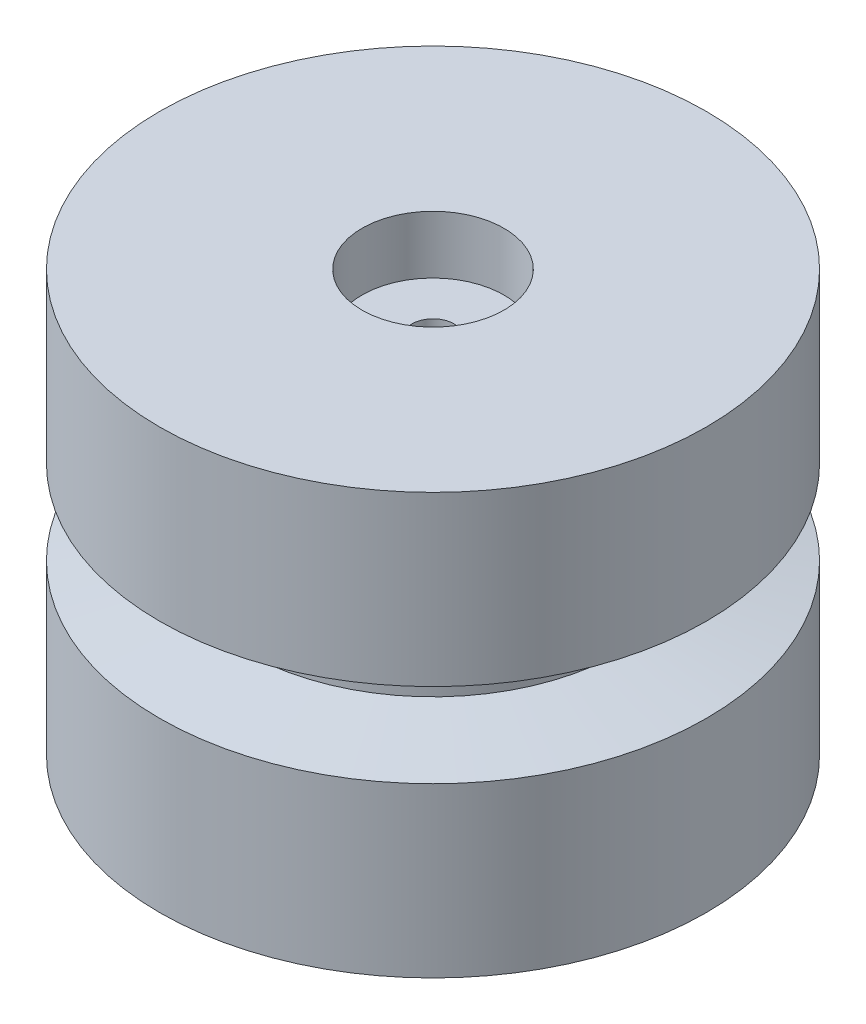
ISO-10303-21;
HEADER;
FILE_DESCRIPTION(('STEP AP214'),'2;1');
FILE_NAME('part.step','',(''),(''),'','','');
FILE_SCHEMA(('AUTOMOTIVE_DESIGN { 1 0 10303 214 1 1 1 1 }'));
ENDSEC;
DATA;
#1=APPLICATION_CONTEXT('core data for automotive mechanical design processes');
#2=APPLICATION_PROTOCOL_DEFINITION('international standard','automotive_design',2000,#1);
#3=PRODUCT_CONTEXT('',#1,'mechanical');
#4=PRODUCT('Part','Part','',(#3));
#5=PRODUCT_RELATED_PRODUCT_CATEGORY('part','',(#4));
#6=PRODUCT_DEFINITION_FORMATION('','',#4);
#7=PRODUCT_DEFINITION_CONTEXT('part definition',#1,'design');
#8=PRODUCT_DEFINITION('design','',#6,#7);
#9=PRODUCT_DEFINITION_SHAPE('','',#8);
#10=(LENGTH_UNIT() NAMED_UNIT(*) SI_UNIT(.MILLI.,.METRE.));
#11=(NAMED_UNIT(*) PLANE_ANGLE_UNIT() SI_UNIT($,.RADIAN.));
#12=(NAMED_UNIT(*) SI_UNIT($,.STERADIAN.) SOLID_ANGLE_UNIT());
#13=UNCERTAINTY_MEASURE_WITH_UNIT(LENGTH_MEASURE(1.E-05),#10,'distance_accuracy_value','');
#14=(GEOMETRIC_REPRESENTATION_CONTEXT(3) GLOBAL_UNCERTAINTY_ASSIGNED_CONTEXT((#13)) GLOBAL_UNIT_ASSIGNED_CONTEXT((#10,
#11,#12)) REPRESENTATION_CONTEXT('',''));
#15=CARTESIAN_POINT('',(0.,0.,0.));
#16=DIRECTION('',(0.,0.,1.));
#17=DIRECTION('',(1.,0.,0.));
#18=AXIS2_PLACEMENT_3D('',#15,#16,#17);
#19=CARTESIAN_POINT('',(0.,40.,0.));
#20=DIRECTION('',(0.,-1.,0.));
#21=DIRECTION('',(0.,0.,-1.));
#22=AXIS2_PLACEMENT_3D('',#19,#20,#21);
#23=CYLINDRICAL_SURFACE('',#22,26.);
#24=CARTESIAN_POINT('',(0.,0.,0.));
#25=DIRECTION('',(0.,1.,0.));
#26=DIRECTION('',(0.,0.,1.));
#27=AXIS2_PLACEMENT_3D('',#24,#25,#26);
#28=CIRCLE('',#27,26.);
#29=CARTESIAN_POINT('',(0.,0.,26.));
#30=VERTEX_POINT('',#29);
#31=EDGE_CURVE('E44',#30,#30,#28,.T.);
#32=ORIENTED_EDGE('',*,*,#31,.T.);
#33=EDGE_LOOP('',(#32));
#34=FACE_BOUND('',#33,.T.);
#35=CARTESIAN_POINT('',(0.,16.,0.));
#36=DIRECTION('',(0.,-1.,0.));
#37=DIRECTION('',(0.,0.,-1.));
#38=AXIS2_PLACEMENT_3D('',#35,#36,#37);
#39=CIRCLE('',#38,26.);
#40=CARTESIAN_POINT('',(0.,16.,-26.));
#41=VERTEX_POINT('',#40);
#42=EDGE_CURVE('E65',#41,#41,#39,.T.);
#43=ORIENTED_EDGE('',*,*,#42,.T.);
#44=EDGE_LOOP('',(#43));
#45=FACE_BOUND('',#44,.T.);
#46=ADVANCED_FACE('F36',(#34,#45),#23,.T.);
#47=CARTESIAN_POINT('',(0.,24.,0.));
#48=DIRECTION('',(0.,-1.,0.));
#49=DIRECTION('',(0.,0.,-1.));
#50=AXIS2_PLACEMENT_3D('',#47,#48,#49);
#51=CIRCLE('',#50,26.);
#52=CARTESIAN_POINT('',(0.,24.,-26.));
#53=VERTEX_POINT('',#52);
#54=EDGE_CURVE('E74',#53,#53,#51,.T.);
#55=ORIENTED_EDGE('',*,*,#54,.F.);
#56=EDGE_LOOP('',(#55));
#57=FACE_BOUND('',#56,.T.);
#58=CARTESIAN_POINT('',(0.,40.,0.));
#59=DIRECTION('',(0.,1.,0.));
#60=DIRECTION('',(0.,0.,1.));
#61=AXIS2_PLACEMENT_3D('',#58,#59,#60);
#62=CIRCLE('',#61,26.);
#63=CARTESIAN_POINT('',(0.,40.,26.));
#64=VERTEX_POINT('',#63);
#65=EDGE_CURVE('E10',#64,#64,#62,.T.);
#66=ORIENTED_EDGE('',*,*,#65,.F.);
#67=EDGE_LOOP('',(#66));
#68=FACE_BOUND('',#67,.T.);
#69=ADVANCED_FACE('F38',(#57,#68),#23,.T.);
#70=CARTESIAN_POINT('',(0.,40.,0.));
#71=DIRECTION('',(0.,1.,0.));
#72=DIRECTION('',(0.,0.,1.));
#73=AXIS2_PLACEMENT_3D('',#70,#71,#72);
#74=PLANE('',#73);
#75=CARTESIAN_POINT('',(0.,40.,0.));
#76=DIRECTION('',(0.,1.,0.));
#77=DIRECTION('',(0.,0.,1.));
#78=AXIS2_PLACEMENT_3D('',#75,#76,#77);
#79=CIRCLE('',#78,6.75);
#80=CARTESIAN_POINT('',(0.,40.,6.75));
#81=VERTEX_POINT('',#80);
#82=EDGE_CURVE('E57',#81,#81,#79,.T.);
#83=ORIENTED_EDGE('',*,*,#82,.F.);
#84=EDGE_LOOP('',(#83));
#85=FACE_BOUND('',#84,.T.);
#86=ORIENTED_EDGE('',*,*,#65,.T.);
#87=EDGE_LOOP('',(#86));
#88=FACE_BOUND('',#87,.T.);
#89=ADVANCED_FACE('F82',(#85,#88),#74,.T.);
#90=CARTESIAN_POINT('',(0.,0.,0.));
#91=DIRECTION('',(0.,1.,0.));
#92=DIRECTION('',(0.,0.,1.));
#93=AXIS2_PLACEMENT_3D('',#90,#91,#92);
#94=PLANE('',#93);
#95=CARTESIAN_POINT('',(0.,0.,0.));
#96=DIRECTION('',(0.,-1.,0.));
#97=DIRECTION('',(0.,0.,-1.));
#98=AXIS2_PLACEMENT_3D('',#95,#96,#97);
#99=CIRCLE('',#98,11.25);
#100=CARTESIAN_POINT('',(0.,0.,-11.25));
#101=VERTEX_POINT('',#100);
#102=EDGE_CURVE('E51',#101,#101,#99,.T.);
#103=ORIENTED_EDGE('',*,*,#102,.F.);
#104=EDGE_LOOP('',(#103));
#105=FACE_BOUND('',#104,.T.);
#106=ORIENTED_EDGE('',*,*,#31,.F.);
#107=EDGE_LOOP('',(#106));
#108=FACE_BOUND('',#107,.T.);
#109=ADVANCED_FACE('F87',(#105,#108),#94,.F.);
#110=CARTESIAN_POINT('',(0.,7.5,0.));
#111=DIRECTION('',(0.,-1.,0.));
#112=DIRECTION('',(0.,0.,-1.));
#113=AXIS2_PLACEMENT_3D('',#110,#111,#112);
#114=CYLINDRICAL_SURFACE('',#113,11.25);
#115=CARTESIAN_POINT('',(0.,7.5,0.));
#116=DIRECTION('',(0.,-1.,0.));
#117=DIRECTION('',(0.,0.,-1.));
#118=AXIS2_PLACEMENT_3D('',#115,#116,#117);
#119=CIRCLE('',#118,11.25);
#120=CARTESIAN_POINT('',(0.,7.5,-11.25));
#121=VERTEX_POINT('',#120);
#122=EDGE_CURVE('E49',#121,#121,#119,.T.);
#123=ORIENTED_EDGE('',*,*,#122,.F.);
#124=EDGE_LOOP('',(#123));
#125=FACE_BOUND('',#124,.T.);
#126=ORIENTED_EDGE('',*,*,#102,.T.);
#127=EDGE_LOOP('',(#126));
#128=FACE_BOUND('',#127,.T.);
#129=ADVANCED_FACE('F124',(#125,#128),#114,.F.);
#130=CARTESIAN_POINT('',(0.,7.5,0.));
#131=DIRECTION('',(0.,-1.,0.));
#132=DIRECTION('',(0.,0.,-1.));
#133=AXIS2_PLACEMENT_3D('',#130,#131,#132);
#134=PLANE('',#133);
#135=CARTESIAN_POINT('',(0.,7.5,0.));
#136=DIRECTION('',(0.,-1.,0.));
#137=DIRECTION('',(0.,0.,-1.));
#138=AXIS2_PLACEMENT_3D('',#135,#136,#137);
#139=CIRCLE('',#138,2.);
#140=CARTESIAN_POINT('',(0.,7.5,-2.));
#141=VERTEX_POINT('',#140);
#142=EDGE_CURVE('E60',#141,#141,#139,.T.);
#143=ORIENTED_EDGE('',*,*,#142,.F.);
#144=EDGE_LOOP('',(#143));
#145=FACE_BOUND('',#144,.T.);
#146=ORIENTED_EDGE('',*,*,#122,.T.);
#147=EDGE_LOOP('',(#146));
#148=FACE_BOUND('',#147,.T.);
#149=ADVANCED_FACE('F120',(#145,#148),#134,.T.);
#150=CARTESIAN_POINT('',(0.,34.5,0.));
#151=DIRECTION('',(0.,1.,0.));
#152=DIRECTION('',(0.,0.,1.));
#153=AXIS2_PLACEMENT_3D('',#150,#151,#152);
#154=CYLINDRICAL_SURFACE('',#153,6.75);
#155=CARTESIAN_POINT('',(0.,34.5,0.));
#156=DIRECTION('',(0.,1.,0.));
#157=DIRECTION('',(0.,0.,1.));
#158=AXIS2_PLACEMENT_3D('',#155,#156,#157);
#159=CIRCLE('',#158,6.75);
#160=CARTESIAN_POINT('',(0.,34.5,6.75));
#161=VERTEX_POINT('',#160);
#162=EDGE_CURVE('E54',#161,#161,#159,.T.);
#163=ORIENTED_EDGE('',*,*,#162,.F.);
#164=EDGE_LOOP('',(#163));
#165=FACE_BOUND('',#164,.T.);
#166=ORIENTED_EDGE('',*,*,#82,.T.);
#167=EDGE_LOOP('',(#166));
#168=FACE_BOUND('',#167,.T.);
#169=ADVANCED_FACE('F116',(#165,#168),#154,.F.);
#170=CARTESIAN_POINT('',(0.,34.5,0.));
#171=DIRECTION('',(0.,1.,0.));
#172=DIRECTION('',(0.,0.,1.));
#173=AXIS2_PLACEMENT_3D('',#170,#171,#172);
#174=PLANE('',#173);
#175=CARTESIAN_POINT('',(0.,34.5,0.));
#176=DIRECTION('',(0.,1.,0.));
#177=DIRECTION('',(0.,0.,1.));
#178=AXIS2_PLACEMENT_3D('',#175,#176,#177);
#179=CIRCLE('',#178,2.);
#180=CARTESIAN_POINT('',(0.,34.5,2.));
#181=VERTEX_POINT('',#180);
#182=EDGE_CURVE('E40',#181,#181,#179,.T.);
#183=ORIENTED_EDGE('',*,*,#182,.F.);
#184=EDGE_LOOP('',(#183));
#185=FACE_BOUND('',#184,.T.);
#186=ORIENTED_EDGE('',*,*,#162,.T.);
#187=EDGE_LOOP('',(#186));
#188=FACE_BOUND('',#187,.T.);
#189=ADVANCED_FACE('F109',(#185,#188),#174,.T.);
#190=CARTESIAN_POINT('',(0.,0.,0.));
#191=DIRECTION('',(0.,1.,0.));
#192=DIRECTION('',(0.,0.,1.));
#193=AXIS2_PLACEMENT_3D('',#190,#191,#192);
#194=CYLINDRICAL_SURFACE('',#193,2.);
#195=ORIENTED_EDGE('',*,*,#142,.T.);
#196=EDGE_LOOP('',(#195));
#197=FACE_BOUND('',#196,.T.);
#198=ORIENTED_EDGE('',*,*,#182,.T.);
#199=EDGE_LOOP('',(#198));
#200=FACE_BOUND('',#199,.T.);
#201=ADVANCED_FACE('F100',(#197,#200),#194,.F.);
#202=CARTESIAN_POINT('',(0.,16.,0.));
#203=DIRECTION('',(0.,-1.,0.));
#204=DIRECTION('',(0.,0.,-1.));
#205=AXIS2_PLACEMENT_3D('',#202,#203,#204);
#206=CONICAL_SURFACE('',#205,26.,1.3854483767992);
#207=CARTESIAN_POINT('',(0.,17.5,0.));
#208=DIRECTION('',(0.,-1.,0.));
#209=DIRECTION('',(0.,0.,-1.));
#210=AXIS2_PLACEMENT_3D('',#207,#208,#209);
#211=CIRCLE('',#210,18.);
#212=CARTESIAN_POINT('',(0.,17.5,-18.));
#213=VERTEX_POINT('',#212);
#214=EDGE_CURVE('E68',#213,#213,#211,.T.);
#215=ORIENTED_EDGE('',*,*,#214,.T.);
#216=EDGE_LOOP('',(#215));
#217=FACE_BOUND('',#216,.T.);
#218=ORIENTED_EDGE('',*,*,#42,.F.);
#219=EDGE_LOOP('',(#218));
#220=FACE_BOUND('',#219,.T.);
#221=ADVANCED_FACE('F97',(#217,#220),#206,.T.);
#222=CARTESIAN_POINT('',(0.,0.,0.));
#223=DIRECTION('',(0.,-1.,0.));
#224=DIRECTION('',(0.,0.,-1.));
#225=AXIS2_PLACEMENT_3D('',#222,#223,#224);
#226=CYLINDRICAL_SURFACE('',#225,18.);
#227=CARTESIAN_POINT('',(0.,22.5,0.));
#228=DIRECTION('',(0.,-1.,0.));
#229=DIRECTION('',(0.,0.,-1.));
#230=AXIS2_PLACEMENT_3D('',#227,#228,#229);
#231=CIRCLE('',#230,18.);
#232=CARTESIAN_POINT('',(0.,22.5,-18.));
#233=VERTEX_POINT('',#232);
#234=EDGE_CURVE('E71',#233,#233,#231,.T.);
#235=ORIENTED_EDGE('',*,*,#234,.T.);
#236=EDGE_LOOP('',(#235));
#237=FACE_BOUND('',#236,.T.);
#238=ORIENTED_EDGE('',*,*,#214,.F.);
#239=EDGE_LOOP('',(#238));
#240=FACE_BOUND('',#239,.T.);
#241=ADVANCED_FACE('F99',(#237,#240),#226,.T.);
#242=CARTESIAN_POINT('',(0.,24.,0.));
#243=DIRECTION('',(0.,1.,0.));
#244=DIRECTION('',(0.,0.,1.));
#245=AXIS2_PLACEMENT_3D('',#242,#243,#244);
#246=CONICAL_SURFACE('',#245,26.,1.3854483767992);
#247=ORIENTED_EDGE('',*,*,#234,.F.);
#248=EDGE_LOOP('',(#247));
#249=FACE_BOUND('',#248,.T.);
#250=ORIENTED_EDGE('',*,*,#54,.T.);
#251=EDGE_LOOP('',(#250));
#252=FACE_BOUND('',#251,.T.);
#253=ADVANCED_FACE('F78',(#249,#252),#246,.T.);
#254=CLOSED_SHELL('',(#46,#69,#89,#109,#129,#149,#169,#189,#201,#221,#241,#253));
#255=MANIFOLD_SOLID_BREP('B2',#254);
#256=ADVANCED_BREP_SHAPE_REPRESENTATION('',(#18,#255),#14);
#257=SHAPE_DEFINITION_REPRESENTATION(#9,#256);
ENDSEC;
END-ISO-10303-21;
